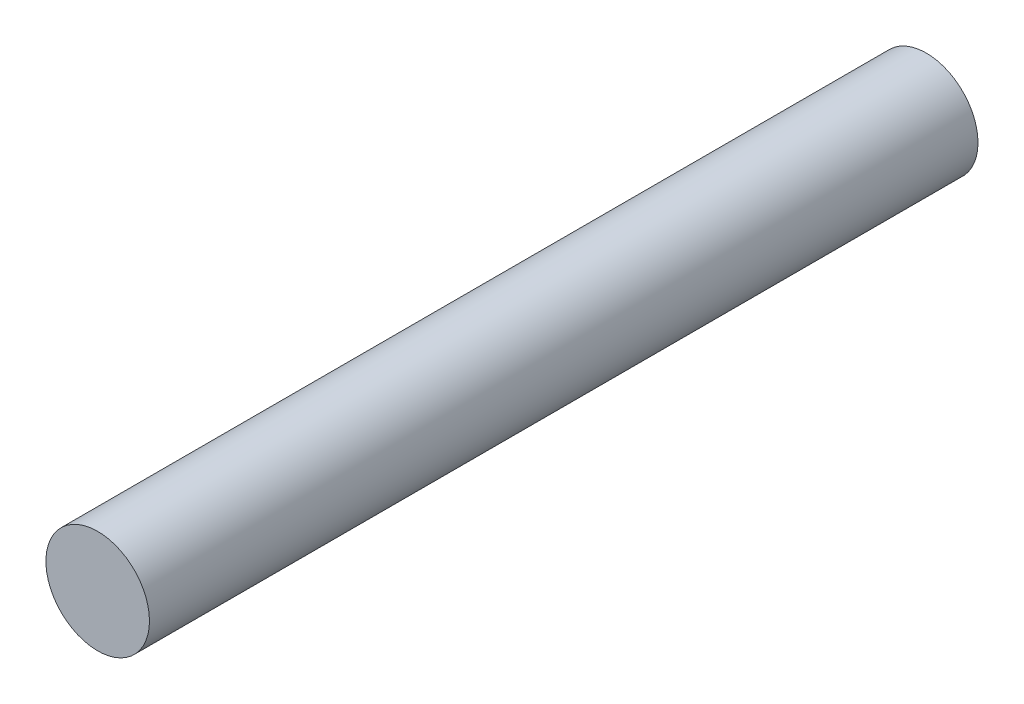
ISO-10303-21;
HEADER;
FILE_DESCRIPTION(('STEP AP214'),'2;1');
FILE_NAME('part.step','',(''),(''),'','','');
FILE_SCHEMA(('AUTOMOTIVE_DESIGN { 1 0 10303 214 1 1 1 1 }'));
ENDSEC;
DATA;
#1=APPLICATION_CONTEXT('core data for automotive mechanical design processes');
#2=APPLICATION_PROTOCOL_DEFINITION('international standard','automotive_design',2000,#1);
#3=PRODUCT_CONTEXT('',#1,'mechanical');
#4=PRODUCT('Part','Part','',(#3));
#5=PRODUCT_RELATED_PRODUCT_CATEGORY('part','',(#4));
#6=PRODUCT_DEFINITION_FORMATION('','',#4);
#7=PRODUCT_DEFINITION_CONTEXT('part definition',#1,'design');
#8=PRODUCT_DEFINITION('design','',#6,#7);
#9=PRODUCT_DEFINITION_SHAPE('','',#8);
#10=(LENGTH_UNIT() NAMED_UNIT(*) SI_UNIT(.MILLI.,.METRE.));
#11=(NAMED_UNIT(*) PLANE_ANGLE_UNIT() SI_UNIT($,.RADIAN.));
#12=(NAMED_UNIT(*) SI_UNIT($,.STERADIAN.) SOLID_ANGLE_UNIT());
#13=UNCERTAINTY_MEASURE_WITH_UNIT(LENGTH_MEASURE(1.E-05),#10,'distance_accuracy_value','');
#14=(GEOMETRIC_REPRESENTATION_CONTEXT(3) GLOBAL_UNCERTAINTY_ASSIGNED_CONTEXT((#13)) GLOBAL_UNIT_ASSIGNED_CONTEXT((#10,
#11,#12)) REPRESENTATION_CONTEXT('',''));
#15=CARTESIAN_POINT('',(0.,0.,0.));
#16=DIRECTION('',(0.,0.,1.));
#17=DIRECTION('',(1.,0.,0.));
#18=AXIS2_PLACEMENT_3D('',#15,#16,#17);
#19=CARTESIAN_POINT('',(0.,0.,40.));
#20=DIRECTION('',(0.,0.,-1.));
#21=DIRECTION('',(-1.,0.,0.));
#22=AXIS2_PLACEMENT_3D('',#19,#20,#21);
#23=CYLINDRICAL_SURFACE('',#22,2.5);
#24=CARTESIAN_POINT('',(0.,0.,40.));
#25=DIRECTION('',(0.,0.,1.));
#26=DIRECTION('',(1.,0.,0.));
#27=AXIS2_PLACEMENT_3D('',#24,#25,#26);
#28=CIRCLE('',#27,2.5);
#29=CARTESIAN_POINT('',(2.5,0.,40.));
#30=VERTEX_POINT('',#29);
#31=EDGE_CURVE('E10',#30,#30,#28,.T.);
#32=ORIENTED_EDGE('',*,*,#31,.F.);
#33=EDGE_LOOP('',(#32));
#34=FACE_BOUND('',#33,.T.);
#35=CARTESIAN_POINT('',(0.,0.,0.));
#36=DIRECTION('',(0.,0.,1.));
#37=DIRECTION('',(1.,0.,0.));
#38=AXIS2_PLACEMENT_3D('',#35,#36,#37);
#39=CIRCLE('',#38,2.5);
#40=CARTESIAN_POINT('',(2.5,0.,0.));
#41=VERTEX_POINT('',#40);
#42=EDGE_CURVE('E40',#41,#41,#39,.T.);
#43=ORIENTED_EDGE('',*,*,#42,.T.);
#44=EDGE_LOOP('',(#43));
#45=FACE_BOUND('',#44,.T.);
#46=ADVANCED_FACE('F37',(#34,#45),#23,.T.);
#47=CARTESIAN_POINT('',(0.,0.,40.));
#48=DIRECTION('',(0.,0.,1.));
#49=DIRECTION('',(1.,0.,0.));
#50=AXIS2_PLACEMENT_3D('',#47,#48,#49);
#51=PLANE('',#50);
#52=ORIENTED_EDGE('',*,*,#31,.T.);
#53=EDGE_LOOP('',(#52));
#54=FACE_BOUND('',#53,.T.);
#55=ADVANCED_FACE('F54',(#54),#51,.T.);
#56=CARTESIAN_POINT('',(0.,0.,0.));
#57=DIRECTION('',(0.,0.,1.));
#58=DIRECTION('',(1.,0.,0.));
#59=AXIS2_PLACEMENT_3D('',#56,#57,#58);
#60=PLANE('',#59);
#61=ORIENTED_EDGE('',*,*,#42,.F.);
#62=EDGE_LOOP('',(#61));
#63=FACE_BOUND('',#62,.T.);
#64=ADVANCED_FACE('F52',(#63),#60,.F.);
#65=CLOSED_SHELL('',(#46,#55,#64));
#66=MANIFOLD_SOLID_BREP('B2',#65);
#67=ADVANCED_BREP_SHAPE_REPRESENTATION('',(#18,#66),#14);
#68=SHAPE_DEFINITION_REPRESENTATION(#9,#67);
ENDSEC;
END-ISO-10303-21;
